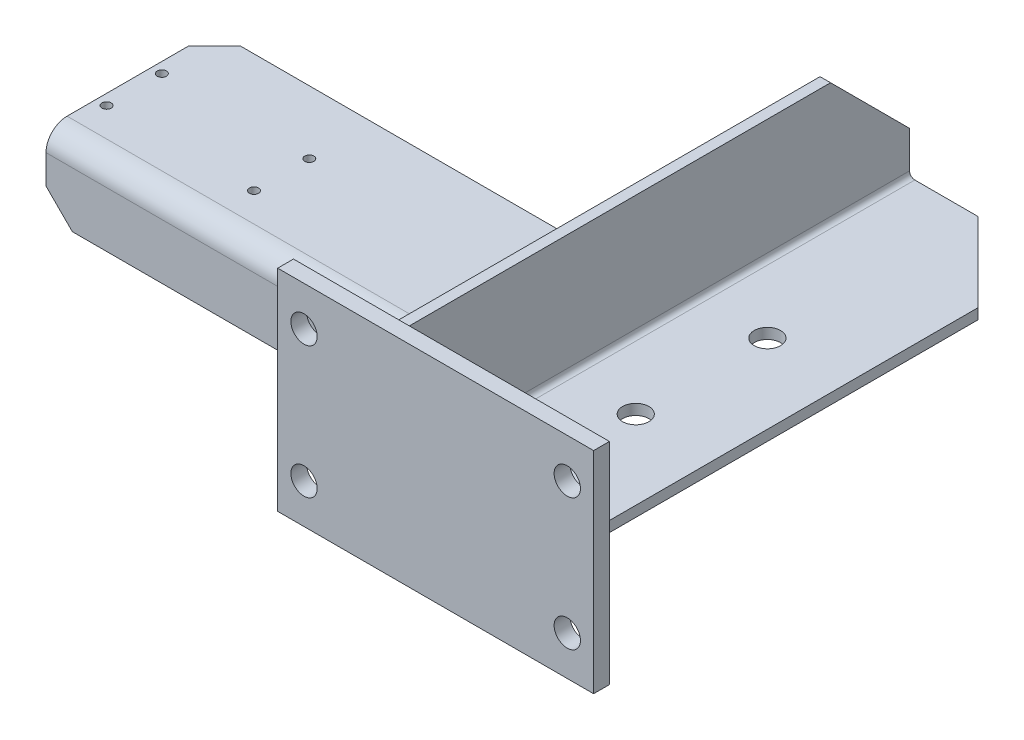
ISO-10303-21;
HEADER;
FILE_DESCRIPTION(('STEP AP214'),'2;1');
FILE_NAME('part.step','',(''),(''),'','','');
FILE_SCHEMA(('AUTOMOTIVE_DESIGN { 1 0 10303 214 1 1 1 1 }'));
ENDSEC;
DATA;
#1=APPLICATION_CONTEXT('core data for automotive mechanical design processes');
#2=APPLICATION_PROTOCOL_DEFINITION('international standard','automotive_design',2000,#1);
#3=PRODUCT_CONTEXT('',#1,'mechanical');
#4=PRODUCT('Part','Part','',(#3));
#5=PRODUCT_RELATED_PRODUCT_CATEGORY('part','',(#4));
#6=PRODUCT_DEFINITION_FORMATION('','',#4);
#7=PRODUCT_DEFINITION_CONTEXT('part definition',#1,'design');
#8=PRODUCT_DEFINITION('design','',#6,#7);
#9=PRODUCT_DEFINITION_SHAPE('','',#8);
#10=(LENGTH_UNIT() NAMED_UNIT(*) SI_UNIT(.MILLI.,.METRE.));
#11=(NAMED_UNIT(*) PLANE_ANGLE_UNIT() SI_UNIT($,.RADIAN.));
#12=(NAMED_UNIT(*) SI_UNIT($,.STERADIAN.) SOLID_ANGLE_UNIT());
#13=UNCERTAINTY_MEASURE_WITH_UNIT(LENGTH_MEASURE(1.E-05),#10,'distance_accuracy_value','');
#14=(GEOMETRIC_REPRESENTATION_CONTEXT(3) GLOBAL_UNCERTAINTY_ASSIGNED_CONTEXT((#13)) GLOBAL_UNIT_ASSIGNED_CONTEXT((#10,
#11,#12)) REPRESENTATION_CONTEXT('',''));
#15=CARTESIAN_POINT('',(0.,0.,0.));
#16=DIRECTION('',(0.,0.,1.));
#17=DIRECTION('',(1.,0.,0.));
#18=AXIS2_PLACEMENT_3D('',#15,#16,#17);
#19=CARTESIAN_POINT('',(0.,0.,206.));
#20=DIRECTION('',(0.,0.,-1.));
#21=DIRECTION('',(-1.,0.,0.));
#22=AXIS2_PLACEMENT_3D('',#19,#20,#21);
#23=PLANE('',#22);
#24=DIRECTION('',(0.,1.,0.));
#25=VECTOR('',#24,1.);
#26=CARTESIAN_POINT('',(90.,60.0000000000001,206.));
#27=LINE('',#26,#25);
#28=CARTESIAN_POINT('',(90.,-19.9999999999999,206.));
#29=VERTEX_POINT('',#28);
#30=CARTESIAN_POINT('',(90.,60.0000000000001,206.));
#31=VERTEX_POINT('',#30);
#32=EDGE_CURVE('E96',#29,#31,#27,.T.);
#33=ORIENTED_EDGE('',*,*,#32,.T.);
#34=DIRECTION('',(-1.,0.,0.));
#35=VECTOR('',#34,1.);
#36=CARTESIAN_POINT('',(90.,60.0000000000001,206.));
#37=LINE('',#36,#35);
#38=CARTESIAN_POINT('',(-30.,60.,206.));
#39=VERTEX_POINT('',#38);
#40=EDGE_CURVE('E91',#31,#39,#37,.T.);
#41=ORIENTED_EDGE('',*,*,#40,.T.);
#42=DIRECTION('',(0.,-1.,0.));
#43=VECTOR('',#42,1.);
#44=CARTESIAN_POINT('',(-30.,60.,206.));
#45=LINE('',#44,#43);
#46=CARTESIAN_POINT('',(-30.,-20.,206.));
#47=VERTEX_POINT('',#46);
#48=EDGE_CURVE('E94',#39,#47,#45,.T.);
#49=ORIENTED_EDGE('',*,*,#48,.T.);
#50=DIRECTION('',(1.,0.,0.));
#51=VECTOR('',#50,1.);
#52=CARTESIAN_POINT('',(90.,-19.9999999999999,206.));
#53=LINE('',#52,#51);
#54=EDGE_CURVE('E61',#47,#29,#53,.T.);
#55=ORIENTED_EDGE('',*,*,#54,.T.);
#56=EDGE_LOOP('',(#33,#41,#49,#55));
#57=FACE_BOUND('',#56,.T.);
#58=CARTESIAN_POINT('',(-20.,45.,206.));
#59=DIRECTION('',(0.,0.,1.));
#60=DIRECTION('',(1.,0.,0.));
#61=AXIS2_PLACEMENT_3D('',#58,#59,#60);
#62=CIRCLE('',#61,5.);
#63=CARTESIAN_POINT('',(-15.,45.,206.));
#64=VERTEX_POINT('',#63);
#65=EDGE_CURVE('E111',#64,#64,#62,.T.);
#66=ORIENTED_EDGE('',*,*,#65,.F.);
#67=EDGE_LOOP('',(#66));
#68=FACE_BOUND('',#67,.T.);
#69=CARTESIAN_POINT('',(80.,45.,206.));
#70=DIRECTION('',(0.,0.,1.));
#71=DIRECTION('',(1.,0.,0.));
#72=AXIS2_PLACEMENT_3D('',#69,#70,#71);
#73=CIRCLE('',#72,5.00000000000001);
#74=CARTESIAN_POINT('',(85.,45.,206.));
#75=VERTEX_POINT('',#74);
#76=EDGE_CURVE('E126',#75,#75,#73,.T.);
#77=ORIENTED_EDGE('',*,*,#76,.F.);
#78=EDGE_LOOP('',(#77));
#79=FACE_BOUND('',#78,.T.);
#80=CARTESIAN_POINT('',(-20.,-4.99999999999997,206.));
#81=DIRECTION('',(0.,0.,1.));
#82=DIRECTION('',(1.,0.,0.));
#83=AXIS2_PLACEMENT_3D('',#80,#81,#82);
#84=CIRCLE('',#83,5.);
#85=CARTESIAN_POINT('',(-15.,-4.99999999999997,206.));
#86=VERTEX_POINT('',#85);
#87=EDGE_CURVE('E132',#86,#86,#84,.T.);
#88=ORIENTED_EDGE('',*,*,#87,.F.);
#89=EDGE_LOOP('',(#88));
#90=FACE_BOUND('',#89,.T.);
#91=CARTESIAN_POINT('',(80.,-4.99999999999998,206.));
#92=DIRECTION('',(0.,0.,1.));
#93=DIRECTION('',(1.,0.,0.));
#94=AXIS2_PLACEMENT_3D('',#91,#92,#93);
#95=CIRCLE('',#94,5.);
#96=CARTESIAN_POINT('',(85.,-4.99999999999998,206.));
#97=VERTEX_POINT('',#96);
#98=EDGE_CURVE('E138',#97,#97,#95,.T.);
#99=ORIENTED_EDGE('',*,*,#98,.F.);
#100=EDGE_LOOP('',(#99));
#101=FACE_BOUND('',#100,.T.);
#102=ADVANCED_FACE('F44',(#57,#68,#79,#90,#101),#23,.F.);
#103=CARTESIAN_POINT('',(0.,0.,200.));
#104=DIRECTION('',(0.,0.,-1.));
#105=DIRECTION('',(-1.,0.,0.));
#106=AXIS2_PLACEMENT_3D('',#103,#104,#105);
#107=PLANE('',#106);
#108=CARTESIAN_POINT('',(-20.,-4.99999999999997,200.));
#109=DIRECTION('',(0.,0.,1.));
#110=DIRECTION('',(1.,0.,0.));
#111=AXIS2_PLACEMENT_3D('',#108,#109,#110);
#112=CIRCLE('',#111,5.);
#113=CARTESIAN_POINT('',(-15.,-4.99999999999997,200.));
#114=VERTEX_POINT('',#113);
#115=EDGE_CURVE('E135',#114,#114,#112,.T.);
#116=ORIENTED_EDGE('',*,*,#115,.T.);
#117=EDGE_LOOP('',(#116));
#118=FACE_BOUND('',#117,.T.);
#119=CARTESIAN_POINT('',(-20.,45.,200.));
#120=DIRECTION('',(0.,0.,1.));
#121=DIRECTION('',(1.,0.,0.));
#122=AXIS2_PLACEMENT_3D('',#119,#120,#121);
#123=CIRCLE('',#122,5.);
#124=CARTESIAN_POINT('',(-15.,45.,200.));
#125=VERTEX_POINT('',#124);
#126=EDGE_CURVE('E123',#125,#125,#123,.T.);
#127=ORIENTED_EDGE('',*,*,#126,.T.);
#128=EDGE_LOOP('',(#127));
#129=FACE_BOUND('',#128,.T.);
#130=DIRECTION('',(0.,1.,0.));
#131=VECTOR('',#130,1.);
#132=CARTESIAN_POINT('',(90.,60.0000000000001,200.));
#133=LINE('',#132,#131);
#134=CARTESIAN_POINT('',(90.,-19.9999999999999,200.));
#135=VERTEX_POINT('',#134);
#136=CARTESIAN_POINT('',(90.,60.0000000000001,200.));
#137=VERTEX_POINT('',#136);
#138=EDGE_CURVE('E108',#135,#137,#133,.T.);
#139=ORIENTED_EDGE('',*,*,#138,.F.);
#140=DIRECTION('',(1.,0.,0.));
#141=VECTOR('',#140,1.);
#142=CARTESIAN_POINT('',(90.,-19.9999999999999,200.));
#143=LINE('',#142,#141);
#144=CARTESIAN_POINT('',(-30.,-20.,200.));
#145=VERTEX_POINT('',#144);
#146=EDGE_CURVE('E84',#145,#135,#143,.T.);
#147=ORIENTED_EDGE('',*,*,#146,.F.);
#148=DIRECTION('',(0.,-1.,0.));
#149=VECTOR('',#148,1.);
#150=CARTESIAN_POINT('',(-30.,60.,200.));
#151=LINE('',#150,#149);
#152=CARTESIAN_POINT('',(-30.,60.,200.));
#153=VERTEX_POINT('',#152);
#154=EDGE_CURVE('E78',#153,#145,#151,.T.);
#155=ORIENTED_EDGE('',*,*,#154,.F.);
#156=DIRECTION('',(-1.,0.,0.));
#157=VECTOR('',#156,1.);
#158=CARTESIAN_POINT('',(90.,60.0000000000001,200.));
#159=LINE('',#158,#157);
#160=EDGE_CURVE('E100',#137,#153,#159,.T.);
#161=ORIENTED_EDGE('',*,*,#160,.F.);
#162=EDGE_LOOP('',(#139,#147,#155,#161));
#163=FACE_BOUND('',#162,.T.);
#164=CARTESIAN_POINT('',(80.,45.,200.));
#165=DIRECTION('',(0.,0.,1.));
#166=DIRECTION('',(1.,0.,0.));
#167=AXIS2_PLACEMENT_3D('',#164,#165,#166);
#168=CIRCLE('',#167,5.00000000000001);
#169=CARTESIAN_POINT('',(85.,45.,200.));
#170=VERTEX_POINT('',#169);
#171=EDGE_CURVE('E129',#170,#170,#168,.T.);
#172=ORIENTED_EDGE('',*,*,#171,.T.);
#173=EDGE_LOOP('',(#172));
#174=FACE_BOUND('',#173,.T.);
#175=CARTESIAN_POINT('',(80.,-4.99999999999998,200.));
#176=DIRECTION('',(0.,0.,1.));
#177=DIRECTION('',(1.,0.,0.));
#178=AXIS2_PLACEMENT_3D('',#175,#176,#177);
#179=CIRCLE('',#178,5.);
#180=CARTESIAN_POINT('',(85.,-4.99999999999998,200.));
#181=VERTEX_POINT('',#180);
#182=EDGE_CURVE('E141',#181,#181,#179,.T.);
#183=ORIENTED_EDGE('',*,*,#182,.T.);
#184=EDGE_LOOP('',(#183));
#185=FACE_BOUND('',#184,.T.);
#186=ADVANCED_FACE('F119',(#118,#129,#163,#174,#185),#107,.T.);
#187=CARTESIAN_POINT('',(90.,60.0000000000001,206.));
#188=DIRECTION('',(-1.,0.,0.));
#189=DIRECTION('',(0.,0.,1.));
#190=AXIS2_PLACEMENT_3D('',#187,#188,#189);
#191=PLANE('',#190);
#192=ORIENTED_EDGE('',*,*,#138,.T.);
#193=DIRECTION('',(0.,0.,-1.));
#194=VECTOR('',#193,1.);
#195=CARTESIAN_POINT('',(90.,60.0000000000001,206.));
#196=LINE('',#195,#194);
#197=EDGE_CURVE('E12',#31,#137,#196,.T.);
#198=ORIENTED_EDGE('',*,*,#197,.F.);
#199=ORIENTED_EDGE('',*,*,#32,.F.);
#200=DIRECTION('',(0.,0.,-1.));
#201=VECTOR('',#200,1.);
#202=CARTESIAN_POINT('',(90.,-19.9999999999999,206.));
#203=LINE('',#202,#201);
#204=EDGE_CURVE('E104',#29,#135,#203,.T.);
#205=ORIENTED_EDGE('',*,*,#204,.T.);
#206=EDGE_LOOP('',(#192,#198,#199,#205));
#207=FACE_BOUND('',#206,.T.);
#208=ADVANCED_FACE('F46',(#207),#191,.F.);
#209=CARTESIAN_POINT('',(90.,60.0000000000001,206.));
#210=DIRECTION('',(0.,-1.,0.));
#211=DIRECTION('',(1.,0.,0.));
#212=AXIS2_PLACEMENT_3D('',#209,#210,#211);
#213=PLANE('',#212);
#214=ORIENTED_EDGE('',*,*,#160,.T.);
#215=DIRECTION('',(0.,0.,-1.));
#216=VECTOR('',#215,1.);
#217=CARTESIAN_POINT('',(-30.,60.,206.));
#218=LINE('',#217,#216);
#219=EDGE_CURVE('E53',#39,#153,#218,.T.);
#220=ORIENTED_EDGE('',*,*,#219,.F.);
#221=ORIENTED_EDGE('',*,*,#40,.F.);
#222=ORIENTED_EDGE('',*,*,#197,.T.);
#223=EDGE_LOOP('',(#214,#220,#221,#222));
#224=FACE_BOUND('',#223,.T.);
#225=ADVANCED_FACE('F99',(#224),#213,.F.);
#226=CARTESIAN_POINT('',(-30.,60.,206.));
#227=DIRECTION('',(1.,0.,0.));
#228=DIRECTION('',(0.,1.,0.));
#229=AXIS2_PLACEMENT_3D('',#226,#227,#228);
#230=PLANE('',#229);
#231=ORIENTED_EDGE('',*,*,#154,.T.);
#232=DIRECTION('',(0.,0.,-1.));
#233=VECTOR('',#232,1.);
#234=CARTESIAN_POINT('',(-30.,-20.,206.));
#235=LINE('',#234,#233);
#236=EDGE_CURVE('E101',#47,#145,#235,.T.);
#237=ORIENTED_EDGE('',*,*,#236,.F.);
#238=ORIENTED_EDGE('',*,*,#48,.F.);
#239=ORIENTED_EDGE('',*,*,#219,.T.);
#240=EDGE_LOOP('',(#231,#237,#238,#239));
#241=FACE_BOUND('',#240,.T.);
#242=ADVANCED_FACE('F102',(#241),#230,.F.);
#243=CARTESIAN_POINT('',(90.,-19.9999999999999,206.));
#244=DIRECTION('',(0.,1.,0.));
#245=DIRECTION('',(-1.,0.,0.));
#246=AXIS2_PLACEMENT_3D('',#243,#244,#245);
#247=PLANE('',#246);
#248=ORIENTED_EDGE('',*,*,#146,.T.);
#249=ORIENTED_EDGE('',*,*,#204,.F.);
#250=ORIENTED_EDGE('',*,*,#54,.F.);
#251=ORIENTED_EDGE('',*,*,#236,.T.);
#252=EDGE_LOOP('',(#248,#249,#250,#251));
#253=FACE_BOUND('',#252,.T.);
#254=ADVANCED_FACE('F116',(#253),#247,.F.);
#255=CARTESIAN_POINT('',(-20.,45.,206.));
#256=DIRECTION('',(0.,0.,-1.));
#257=DIRECTION('',(-1.,0.,0.));
#258=AXIS2_PLACEMENT_3D('',#255,#256,#257);
#259=CYLINDRICAL_SURFACE('',#258,5.);
#260=ORIENTED_EDGE('',*,*,#65,.T.);
#261=EDGE_LOOP('',(#260));
#262=FACE_BOUND('',#261,.T.);
#263=ORIENTED_EDGE('',*,*,#126,.F.);
#264=EDGE_LOOP('',(#263));
#265=FACE_BOUND('',#264,.T.);
#266=ADVANCED_FACE('F158',(#262,#265),#259,.F.);
#267=CARTESIAN_POINT('',(80.,45.,206.));
#268=DIRECTION('',(0.,0.,-1.));
#269=DIRECTION('',(-1.,0.,0.));
#270=AXIS2_PLACEMENT_3D('',#267,#268,#269);
#271=CYLINDRICAL_SURFACE('',#270,5.00000000000001);
#272=ORIENTED_EDGE('',*,*,#76,.T.);
#273=EDGE_LOOP('',(#272));
#274=FACE_BOUND('',#273,.T.);
#275=ORIENTED_EDGE('',*,*,#171,.F.);
#276=EDGE_LOOP('',(#275));
#277=FACE_BOUND('',#276,.T.);
#278=ADVANCED_FACE('F204',(#274,#277),#271,.F.);
#279=CARTESIAN_POINT('',(-20.,-4.99999999999997,206.));
#280=DIRECTION('',(0.,0.,-1.));
#281=DIRECTION('',(-1.,0.,0.));
#282=AXIS2_PLACEMENT_3D('',#279,#280,#281);
#283=CYLINDRICAL_SURFACE('',#282,5.);
#284=ORIENTED_EDGE('',*,*,#87,.T.);
#285=EDGE_LOOP('',(#284));
#286=FACE_BOUND('',#285,.T.);
#287=ORIENTED_EDGE('',*,*,#115,.F.);
#288=EDGE_LOOP('',(#287));
#289=FACE_BOUND('',#288,.T.);
#290=ADVANCED_FACE('F212',(#286,#289),#283,.F.);
#291=CARTESIAN_POINT('',(80.,-4.99999999999998,206.));
#292=DIRECTION('',(0.,0.,-1.));
#293=DIRECTION('',(-1.,0.,0.));
#294=AXIS2_PLACEMENT_3D('',#291,#292,#293);
#295=CYLINDRICAL_SURFACE('',#294,5.);
#296=ORIENTED_EDGE('',*,*,#98,.T.);
#297=EDGE_LOOP('',(#296));
#298=FACE_BOUND('',#297,.T.);
#299=ORIENTED_EDGE('',*,*,#182,.F.);
#300=EDGE_LOOP('',(#299));
#301=FACE_BOUND('',#300,.T.);
#302=ADVANCED_FACE('F147',(#298,#301),#295,.F.);
#303=CLOSED_SHELL('',(#102,#186,#208,#225,#242,#254,#266,#278,#290,#302));
#304=MANIFOLD_SOLID_BREP('B2',#303);
#305=CARTESIAN_POINT('',(0.,6.00000000000004,200.));
#306=DIRECTION('',(1.,0.,0.));
#307=DIRECTION('',(0.,0.,-1.));
#308=AXIS2_PLACEMENT_3D('',#305,#306,#307);
#309=PLANE('',#308);
#310=DIRECTION('',(0.,-1.,0.));
#311=VECTOR('',#310,1.);
#312=CARTESIAN_POINT('',(0.,6.00000000000004,175.));
#313=LINE('',#312,#311);
#314=CARTESIAN_POINT('',(0.,27.,175.));
#315=VERTEX_POINT('',#314);
#316=CARTESIAN_POINT('',(0.,6.00000000000004,175.));
#317=VERTEX_POINT('',#316);
#318=EDGE_CURVE('E422',#315,#317,#313,.T.);
#319=ORIENTED_EDGE('',*,*,#318,.F.);
#320=CARTESIAN_POINT('',(0.,27.,171.));
#321=DIRECTION('',(1.,0.,0.));
#322=DIRECTION('',(0.,0.,-1.));
#323=AXIS2_PLACEMENT_3D('',#320,#321,#322);
#324=CIRCLE('',#323,4.00000000000002);
#325=CARTESIAN_POINT('',(0.,31.,171.));
#326=VERTEX_POINT('',#325);
#327=EDGE_CURVE('E440',#326,#315,#324,.T.);
#328=ORIENTED_EDGE('',*,*,#327,.F.);
#329=DIRECTION('',(0.,0.,1.));
#330=VECTOR('',#329,1.);
#331=CARTESIAN_POINT('',(0.,31.,171.));
#332=LINE('',#331,#330);
#333=CARTESIAN_POINT('',(0.,31.,115.));
#334=VERTEX_POINT('',#333);
#335=EDGE_CURVE('E438',#334,#326,#332,.T.);
#336=ORIENTED_EDGE('',*,*,#335,.F.);
#337=DIRECTION('',(0.,-1.,0.));
#338=VECTOR('',#337,1.);
#339=CARTESIAN_POINT('',(0.,35.,115.));
#340=LINE('',#339,#338);
#341=CARTESIAN_POINT('',(0.,35.,115.));
#342=VERTEX_POINT('',#341);
#343=EDGE_CURVE('E435',#342,#334,#340,.T.);
#344=ORIENTED_EDGE('',*,*,#343,.F.);
#345=DIRECTION('',(0.,0.,-1.));
#346=VECTOR('',#345,1.);
#347=CARTESIAN_POINT('',(0.,35.,171.));
#348=LINE('',#347,#346);
#349=CARTESIAN_POINT('',(0.,35.,171.));
#350=VERTEX_POINT('',#349);
#351=EDGE_CURVE('E432',#350,#342,#348,.T.);
#352=ORIENTED_EDGE('',*,*,#351,.F.);
#353=CARTESIAN_POINT('',(0.,27.,171.));
#354=DIRECTION('',(-1.,0.,0.));
#355=DIRECTION('',(0.,0.,-1.));
#356=AXIS2_PLACEMENT_3D('',#353,#354,#355);
#357=CIRCLE('',#356,8.);
#358=CARTESIAN_POINT('',(0.,27.,179.));
#359=VERTEX_POINT('',#358);
#360=EDGE_CURVE('E430',#359,#350,#357,.T.);
#361=ORIENTED_EDGE('',*,*,#360,.F.);
#362=DIRECTION('',(0.,1.,0.));
#363=VECTOR('',#362,1.);
#364=CARTESIAN_POINT('',(0.,6.00000000000004,179.));
#365=LINE('',#364,#363);
#366=CARTESIAN_POINT('',(0.,6.00000000000004,179.));
#367=VERTEX_POINT('',#366);
#368=EDGE_CURVE('E403',#367,#359,#365,.T.);
#369=ORIENTED_EDGE('',*,*,#368,.F.);
#370=DIRECTION('',(0.,0.,-1.));
#371=VECTOR('',#370,1.);
#372=CARTESIAN_POINT('',(0.,6.00000000000004,200.));
#373=LINE('',#372,#371);
#374=CARTESIAN_POINT('',(0.,6.00000000000004,200.));
#375=VERTEX_POINT('',#374);
#376=EDGE_CURVE('E518',#375,#367,#373,.T.);
#377=ORIENTED_EDGE('',*,*,#376,.F.);
#378=DIRECTION('',(0.,-1.,0.));
#379=VECTOR('',#378,1.);
#380=CARTESIAN_POINT('',(0.,6.00000000000004,200.));
#381=LINE('',#380,#379);
#382=CARTESIAN_POINT('',(0.,50.,200.));
#383=VERTEX_POINT('',#382);
#384=EDGE_CURVE('E471',#383,#375,#381,.T.);
#385=ORIENTED_EDGE('',*,*,#384,.F.);
#386=DIRECTION('',(0.,0.,-1.));
#387=VECTOR('',#386,1.);
#388=CARTESIAN_POINT('',(0.,50.,200.));
#389=LINE('',#388,#387);
#390=CARTESIAN_POINT('',(0.,50.,30.));
#391=VERTEX_POINT('',#390);
#392=EDGE_CURVE('E521',#383,#391,#389,.T.);
#393=ORIENTED_EDGE('',*,*,#392,.T.);
#394=DIRECTION('',(0.,0.707106781186548,0.707106781186547));
#395=VECTOR('',#394,1.);
#396=CARTESIAN_POINT('',(0.,50.,30.));
#397=LINE('',#396,#395);
#398=CARTESIAN_POINT('',(0.,20.,0.));
#399=VERTEX_POINT('',#398);
#400=EDGE_CURVE('E527',#391,#399,#397,.F.);
#401=ORIENTED_EDGE('',*,*,#400,.T.);
#402=DIRECTION('',(0.,-1.,0.));
#403=VECTOR('',#402,1.);
#404=CARTESIAN_POINT('',(0.,6.00000000000004,0.));
#405=LINE('',#404,#403);
#406=CARTESIAN_POINT('',(0.,6.00000000000004,0.));
#407=VERTEX_POINT('',#406);
#408=EDGE_CURVE('E463',#399,#407,#405,.T.);
#409=ORIENTED_EDGE('',*,*,#408,.T.);
#410=EDGE_CURVE('E517',#317,#407,#373,.T.);
#411=ORIENTED_EDGE('',*,*,#410,.F.);
#412=EDGE_LOOP('',(#319,#328,#336,#344,#352,#361,#369,#377,#385,#393,#401,#409,#411));
#413=FACE_BOUND('',#412,.T.);
#414=ADVANCED_FACE('F251',(#413),#309,.F.);
#415=CARTESIAN_POINT('',(4.,50.,200.));
#416=DIRECTION('',(0.,-1.,0.));
#417=DIRECTION('',(0.,0.,-1.));
#418=AXIS2_PLACEMENT_3D('',#415,#416,#417);
#419=PLANE('',#418);
#420=DIRECTION('',(0.,0.,-1.));
#421=VECTOR('',#420,1.);
#422=CARTESIAN_POINT('',(4.,50.,200.));
#423=LINE('',#422,#421);
#424=CARTESIAN_POINT('',(4.,50.,200.));
#425=VERTEX_POINT('',#424);
#426=CARTESIAN_POINT('',(4.,50.,30.));
#427=VERTEX_POINT('',#426);
#428=EDGE_CURVE('E486',#425,#427,#423,.T.);
#429=ORIENTED_EDGE('',*,*,#428,.T.);
#430=DIRECTION('',(-1.,0.,0.));
#431=VECTOR('',#430,1.);
#432=CARTESIAN_POINT('',(4.,50.,30.));
#433=LINE('',#432,#431);
#434=EDGE_CURVE('E524',#427,#391,#433,.T.);
#435=ORIENTED_EDGE('',*,*,#434,.T.);
#436=ORIENTED_EDGE('',*,*,#392,.F.);
#437=DIRECTION('',(-1.,0.,0.));
#438=VECTOR('',#437,1.);
#439=CARTESIAN_POINT('',(4.,50.,200.));
#440=LINE('',#439,#438);
#441=EDGE_CURVE('E468',#425,#383,#440,.T.);
#442=ORIENTED_EDGE('',*,*,#441,.F.);
#443=EDGE_LOOP('',(#429,#435,#436,#442));
#444=FACE_BOUND('',#443,.T.);
#445=ADVANCED_FACE('F582',(#444),#419,.F.);
#446=CARTESIAN_POINT('',(6.,6.,200.));
#447=DIRECTION('',(0.,0.,-1.));
#448=DIRECTION('',(-1.,0.,0.));
#449=AXIS2_PLACEMENT_3D('',#446,#447,#448);
#450=CYLINDRICAL_SURFACE('',#449,6.);
#451=CARTESIAN_POINT('',(6.,6.,0.));
#452=DIRECTION('',(0.,0.,1.));
#453=DIRECTION('',(1.,0.,0.));
#454=AXIS2_PLACEMENT_3D('',#451,#452,#453);
#455=CIRCLE('',#454,6.);
#456=CARTESIAN_POINT('',(6.00000000000004,0.,0.));
#457=VERTEX_POINT('',#456);
#458=EDGE_CURVE('E489',#407,#457,#455,.T.);
#459=ORIENTED_EDGE('',*,*,#458,.T.);
#460=DIRECTION('',(0.,0.,-1.));
#461=VECTOR('',#460,1.);
#462=CARTESIAN_POINT('',(6.00000000000004,0.,200.));
#463=LINE('',#462,#461);
#464=CARTESIAN_POINT('',(6.00000000000004,0.,200.));
#465=VERTEX_POINT('',#464);
#466=EDGE_CURVE('E514',#465,#457,#463,.T.);
#467=ORIENTED_EDGE('',*,*,#466,.F.);
#468=CARTESIAN_POINT('',(6.,6.,200.));
#469=DIRECTION('',(0.,0.,1.));
#470=DIRECTION('',(1.,0.,0.));
#471=AXIS2_PLACEMENT_3D('',#468,#469,#470);
#472=CIRCLE('',#471,6.);
#473=EDGE_CURVE('E474',#375,#465,#472,.T.);
#474=ORIENTED_EDGE('',*,*,#473,.F.);
#475=ORIENTED_EDGE('',*,*,#376,.T.);
#476=DIRECTION('',(0.,0.,1.));
#477=VECTOR('',#476,1.);
#478=CARTESIAN_POINT('',(0.,6.00000000000004,179.));
#479=LINE('',#478,#477);
#480=EDGE_CURVE('E425',#317,#367,#479,.T.);
#481=ORIENTED_EDGE('',*,*,#480,.F.);
#482=ORIENTED_EDGE('',*,*,#410,.T.);
#483=EDGE_LOOP('',(#459,#467,#474,#475,#481,#482));
#484=FACE_BOUND('',#483,.T.);
#485=ADVANCED_FACE('F572',(#484),#450,.T.);
#486=CARTESIAN_POINT('',(6.00000000000004,0.,200.));
#487=DIRECTION('',(0.,1.,0.));
#488=DIRECTION('',(0.,0.,1.));
#489=AXIS2_PLACEMENT_3D('',#486,#487,#488);
#490=PLANE('',#489);
#491=CARTESIAN_POINT('',(30.,0.,130.));
#492=DIRECTION('',(0.,1.,0.));
#493=DIRECTION('',(0.,0.,1.));
#494=AXIS2_PLACEMENT_3D('',#491,#492,#493);
#495=CIRCLE('',#494,5.00000000000001);
#496=CARTESIAN_POINT('',(30.,0.,135.));
#497=VERTEX_POINT('',#496);
#498=EDGE_CURVE('E459',#497,#497,#495,.F.);
#499=ORIENTED_EDGE('',*,*,#498,.F.);
#500=EDGE_LOOP('',(#499));
#501=FACE_BOUND('',#500,.T.);
#502=CARTESIAN_POINT('',(30.,0.,80.));
#503=DIRECTION('',(0.,1.,0.));
#504=DIRECTION('',(0.,0.,1.));
#505=AXIS2_PLACEMENT_3D('',#502,#503,#504);
#506=CIRCLE('',#505,5.00000000000001);
#507=CARTESIAN_POINT('',(30.,0.,85.));
#508=VERTEX_POINT('',#507);
#509=EDGE_CURVE('E460',#508,#508,#506,.F.);
#510=ORIENTED_EDGE('',*,*,#509,.F.);
#511=EDGE_LOOP('',(#510));
#512=FACE_BOUND('',#511,.T.);
#513=DIRECTION('',(1.,0.,0.));
#514=VECTOR('',#513,1.);
#515=CARTESIAN_POINT('',(6.00000000000004,0.,0.));
#516=LINE('',#515,#514);
#517=CARTESIAN_POINT('',(29.9999999999999,0.,0.));
#518=VERTEX_POINT('',#517);
#519=EDGE_CURVE('E491',#457,#518,#516,.T.);
#520=ORIENTED_EDGE('',*,*,#519,.T.);
#521=DIRECTION('',(-0.707106781186549,0.,-0.707106781186546));
#522=VECTOR('',#521,1.);
#523=CARTESIAN_POINT('',(60.,0.,30.));
#524=LINE('',#523,#522);
#525=CARTESIAN_POINT('',(60.,0.,30.));
#526=VERTEX_POINT('',#525);
#527=EDGE_CURVE('E540',#518,#526,#524,.F.);
#528=ORIENTED_EDGE('',*,*,#527,.T.);
#529=DIRECTION('',(0.,0.,-1.));
#530=VECTOR('',#529,1.);
#531=CARTESIAN_POINT('',(60.,0.,200.));
#532=LINE('',#531,#530);
#533=CARTESIAN_POINT('',(60.,0.,200.));
#534=VERTEX_POINT('',#533);
#535=EDGE_CURVE('E511',#534,#526,#532,.T.);
#536=ORIENTED_EDGE('',*,*,#535,.F.);
#537=DIRECTION('',(1.,0.,0.));
#538=VECTOR('',#537,1.);
#539=CARTESIAN_POINT('',(6.00000000000004,0.,200.));
#540=LINE('',#539,#538);
#541=EDGE_CURVE('E476',#465,#534,#540,.T.);
#542=ORIENTED_EDGE('',*,*,#541,.F.);
#543=ORIENTED_EDGE('',*,*,#466,.T.);
#544=EDGE_LOOP('',(#520,#528,#536,#542,#543));
#545=FACE_BOUND('',#544,.T.);
#546=ADVANCED_FACE('F611',(#501,#512,#545),#490,.F.);
#547=CARTESIAN_POINT('',(60.,4.,200.));
#548=DIRECTION('',(-1.,0.,0.));
#549=DIRECTION('',(0.,0.,1.));
#550=AXIS2_PLACEMENT_3D('',#547,#548,#549);
#551=PLANE('',#550);
#552=ORIENTED_EDGE('',*,*,#535,.T.);
#553=DIRECTION('',(0.,1.,0.));
#554=VECTOR('',#553,1.);
#555=CARTESIAN_POINT('',(60.,4.,30.));
#556=LINE('',#555,#554);
#557=CARTESIAN_POINT('',(60.,4.,30.));
#558=VERTEX_POINT('',#557);
#559=EDGE_CURVE('E535',#526,#558,#556,.T.);
#560=ORIENTED_EDGE('',*,*,#559,.T.);
#561=DIRECTION('',(0.,0.,-1.));
#562=VECTOR('',#561,1.);
#563=CARTESIAN_POINT('',(60.,4.,200.));
#564=LINE('',#563,#562);
#565=CARTESIAN_POINT('',(60.,4.,200.));
#566=VERTEX_POINT('',#565);
#567=EDGE_CURVE('E508',#566,#558,#564,.T.);
#568=ORIENTED_EDGE('',*,*,#567,.F.);
#569=DIRECTION('',(0.,1.,0.));
#570=VECTOR('',#569,1.);
#571=CARTESIAN_POINT('',(60.,4.,200.));
#572=LINE('',#571,#570);
#573=EDGE_CURVE('E478',#534,#566,#572,.T.);
#574=ORIENTED_EDGE('',*,*,#573,.F.);
#575=EDGE_LOOP('',(#552,#560,#568,#574));
#576=FACE_BOUND('',#575,.T.);
#577=ADVANCED_FACE('F614',(#576),#551,.F.);
#578=CARTESIAN_POINT('',(6.00000000000004,4.,200.));
#579=DIRECTION('',(0.,-1.,0.));
#580=DIRECTION('',(0.,0.,-1.));
#581=AXIS2_PLACEMENT_3D('',#578,#579,#580);
#582=PLANE('',#581);
#583=CARTESIAN_POINT('',(30.,4.,130.));
#584=DIRECTION('',(0.,1.,0.));
#585=DIRECTION('',(0.,0.,1.));
#586=AXIS2_PLACEMENT_3D('',#583,#584,#585);
#587=CIRCLE('',#586,5.00000000000001);
#588=CARTESIAN_POINT('',(30.,4.,135.));
#589=VERTEX_POINT('',#588);
#590=EDGE_CURVE('E456',#589,#589,#587,.T.);
#591=ORIENTED_EDGE('',*,*,#590,.F.);
#592=EDGE_LOOP('',(#591));
#593=FACE_BOUND('',#592,.T.);
#594=CARTESIAN_POINT('',(30.,4.,80.));
#595=DIRECTION('',(0.,1.,0.));
#596=DIRECTION('',(0.,0.,1.));
#597=AXIS2_PLACEMENT_3D('',#594,#595,#596);
#598=CIRCLE('',#597,5.00000000000001);
#599=CARTESIAN_POINT('',(30.,4.,85.));
#600=VERTEX_POINT('',#599);
#601=EDGE_CURVE('E455',#600,#600,#598,.T.);
#602=ORIENTED_EDGE('',*,*,#601,.F.);
#603=EDGE_LOOP('',(#602));
#604=FACE_BOUND('',#603,.T.);
#605=ORIENTED_EDGE('',*,*,#567,.T.);
#606=DIRECTION('',(0.707106781186549,0.,0.707106781186546));
#607=VECTOR('',#606,1.);
#608=CARTESIAN_POINT('',(60.,4.,30.));
#609=LINE('',#608,#607);
#610=CARTESIAN_POINT('',(29.9999999999999,4.,0.));
#611=VERTEX_POINT('',#610);
#612=EDGE_CURVE('E538',#558,#611,#609,.F.);
#613=ORIENTED_EDGE('',*,*,#612,.T.);
#614=DIRECTION('',(-1.,0.,0.));
#615=VECTOR('',#614,1.);
#616=CARTESIAN_POINT('',(6.00000000000004,4.,0.));
#617=LINE('',#616,#615);
#618=CARTESIAN_POINT('',(6.00000000000004,4.,0.));
#619=VERTEX_POINT('',#618);
#620=EDGE_CURVE('E494',#611,#619,#617,.T.);
#621=ORIENTED_EDGE('',*,*,#620,.T.);
#622=DIRECTION('',(0.,0.,-1.));
#623=VECTOR('',#622,1.);
#624=CARTESIAN_POINT('',(6.00000000000004,4.,200.));
#625=LINE('',#624,#623);
#626=CARTESIAN_POINT('',(6.00000000000004,4.,200.));
#627=VERTEX_POINT('',#626);
#628=EDGE_CURVE('E505',#627,#619,#625,.T.);
#629=ORIENTED_EDGE('',*,*,#628,.F.);
#630=DIRECTION('',(-1.,0.,0.));
#631=VECTOR('',#630,1.);
#632=CARTESIAN_POINT('',(6.00000000000004,4.,200.));
#633=LINE('',#632,#631);
#634=EDGE_CURVE('E480',#566,#627,#633,.T.);
#635=ORIENTED_EDGE('',*,*,#634,.F.);
#636=EDGE_LOOP('',(#605,#613,#621,#629,#635));
#637=FACE_BOUND('',#636,.T.);
#638=ADVANCED_FACE('F617',(#593,#604,#637),#582,.F.);
#639=CARTESIAN_POINT('',(6.,6.,200.));
#640=DIRECTION('',(0.,0.,-1.));
#641=DIRECTION('',(-1.,0.,0.));
#642=AXIS2_PLACEMENT_3D('',#639,#640,#641);
#643=CYLINDRICAL_SURFACE('',#642,2.);
#644=CARTESIAN_POINT('',(6.,6.,0.));
#645=DIRECTION('',(0.,0.,-1.));
#646=DIRECTION('',(1.,0.,0.));
#647=AXIS2_PLACEMENT_3D('',#644,#645,#646);
#648=CIRCLE('',#647,2.);
#649=CARTESIAN_POINT('',(4.,6.00000000000002,0.));
#650=VERTEX_POINT('',#649);
#651=EDGE_CURVE('E496',#619,#650,#648,.T.);
#652=ORIENTED_EDGE('',*,*,#651,.T.);
#653=DIRECTION('',(0.,0.,-1.));
#654=VECTOR('',#653,1.);
#655=CARTESIAN_POINT('',(4.,6.00000000000002,200.));
#656=LINE('',#655,#654);
#657=CARTESIAN_POINT('',(4.,6.00000000000002,200.));
#658=VERTEX_POINT('',#657);
#659=EDGE_CURVE('E502',#658,#650,#656,.T.);
#660=ORIENTED_EDGE('',*,*,#659,.F.);
#661=CARTESIAN_POINT('',(6.,6.,200.));
#662=DIRECTION('',(0.,0.,-1.));
#663=DIRECTION('',(1.,0.,0.));
#664=AXIS2_PLACEMENT_3D('',#661,#662,#663);
#665=CIRCLE('',#664,2.);
#666=EDGE_CURVE('E482',#627,#658,#665,.T.);
#667=ORIENTED_EDGE('',*,*,#666,.F.);
#668=ORIENTED_EDGE('',*,*,#628,.T.);
#669=EDGE_LOOP('',(#652,#660,#667,#668));
#670=FACE_BOUND('',#669,.T.);
#671=ADVANCED_FACE('F600',(#670),#643,.F.);
#672=CARTESIAN_POINT('',(4.,6.00000000000002,200.));
#673=DIRECTION('',(-1.,0.,0.));
#674=DIRECTION('',(0.,0.,1.));
#675=AXIS2_PLACEMENT_3D('',#672,#673,#674);
#676=PLANE('',#675);
#677=DIRECTION('',(0.,1.,0.));
#678=VECTOR('',#677,1.);
#679=CARTESIAN_POINT('',(4.,6.00000000000002,0.));
#680=LINE('',#679,#678);
#681=CARTESIAN_POINT('',(4.,20.,0.));
#682=VERTEX_POINT('',#681);
#683=EDGE_CURVE('E472',#650,#682,#680,.T.);
#684=ORIENTED_EDGE('',*,*,#683,.T.);
#685=DIRECTION('',(0.,-0.707106781186548,-0.707106781186547));
#686=VECTOR('',#685,1.);
#687=CARTESIAN_POINT('',(4.,50.,30.));
#688=LINE('',#687,#686);
#689=EDGE_CURVE('E533',#682,#427,#688,.F.);
#690=ORIENTED_EDGE('',*,*,#689,.T.);
#691=ORIENTED_EDGE('',*,*,#428,.F.);
#692=DIRECTION('',(0.,1.,0.));
#693=VECTOR('',#692,1.);
#694=CARTESIAN_POINT('',(4.,6.00000000000002,200.));
#695=LINE('',#694,#693);
#696=EDGE_CURVE('E484',#658,#425,#695,.T.);
#697=ORIENTED_EDGE('',*,*,#696,.F.);
#698=ORIENTED_EDGE('',*,*,#659,.T.);
#699=EDGE_LOOP('',(#684,#690,#691,#697,#698));
#700=FACE_BOUND('',#699,.T.);
#701=ADVANCED_FACE('F595',(#700),#676,.F.);
#702=CARTESIAN_POINT('',(6.,6.,200.));
#703=DIRECTION('',(0.,0.,1.));
#704=DIRECTION('',(1.,0.,0.));
#705=AXIS2_PLACEMENT_3D('',#702,#703,#704);
#706=PLANE('',#705);
#707=ORIENTED_EDGE('',*,*,#441,.T.);
#708=ORIENTED_EDGE('',*,*,#384,.T.);
#709=ORIENTED_EDGE('',*,*,#473,.T.);
#710=ORIENTED_EDGE('',*,*,#541,.T.);
#711=ORIENTED_EDGE('',*,*,#573,.T.);
#712=ORIENTED_EDGE('',*,*,#634,.T.);
#713=ORIENTED_EDGE('',*,*,#666,.T.);
#714=ORIENTED_EDGE('',*,*,#696,.T.);
#715=EDGE_LOOP('',(#707,#708,#709,#710,#711,#712,#713,#714));
#716=FACE_BOUND('',#715,.T.);
#717=ADVANCED_FACE('F576',(#716),#706,.T.);
#718=CARTESIAN_POINT('',(6.,6.,0.));
#719=DIRECTION('',(0.,0.,1.));
#720=DIRECTION('',(1.,0.,0.));
#721=AXIS2_PLACEMENT_3D('',#718,#719,#720);
#722=PLANE('',#721);
#723=ORIENTED_EDGE('',*,*,#408,.F.);
#724=DIRECTION('',(1.,0.,0.));
#725=VECTOR('',#724,1.);
#726=CARTESIAN_POINT('',(6.,20.,0.));
#727=LINE('',#726,#725);
#728=EDGE_CURVE('E531',#399,#682,#727,.T.);
#729=ORIENTED_EDGE('',*,*,#728,.T.);
#730=ORIENTED_EDGE('',*,*,#683,.F.);
#731=ORIENTED_EDGE('',*,*,#651,.F.);
#732=ORIENTED_EDGE('',*,*,#620,.F.);
#733=DIRECTION('',(0.,-1.,0.));
#734=VECTOR('',#733,1.);
#735=CARTESIAN_POINT('',(29.9999999999999,6.,0.));
#736=LINE('',#735,#734);
#737=EDGE_CURVE('E529',#611,#518,#736,.T.);
#738=ORIENTED_EDGE('',*,*,#737,.T.);
#739=ORIENTED_EDGE('',*,*,#519,.F.);
#740=ORIENTED_EDGE('',*,*,#458,.F.);
#741=EDGE_LOOP('',(#723,#729,#730,#731,#732,#738,#739,#740));
#742=FACE_BOUND('',#741,.T.);
#743=ADVANCED_FACE('F591',(#742),#722,.F.);
#744=CARTESIAN_POINT('',(4.,50.,30.));
#745=DIRECTION('',(0.,-0.707106781186547,0.707106781186548));
#746=DIRECTION('',(-1.,0.,0.));
#747=AXIS2_PLACEMENT_3D('',#744,#745,#746);
#748=PLANE('',#747);
#749=ORIENTED_EDGE('',*,*,#689,.F.);
#750=ORIENTED_EDGE('',*,*,#728,.F.);
#751=ORIENTED_EDGE('',*,*,#400,.F.);
#752=ORIENTED_EDGE('',*,*,#434,.F.);
#753=EDGE_LOOP('',(#749,#750,#751,#752));
#754=FACE_BOUND('',#753,.T.);
#755=ADVANCED_FACE('F587',(#754),#748,.F.);
#756=CARTESIAN_POINT('',(60.,4.,30.));
#757=DIRECTION('',(-0.707106781186546,0.,0.707106781186549));
#758=DIRECTION('',(0.,1.,0.));
#759=AXIS2_PLACEMENT_3D('',#756,#757,#758);
#760=PLANE('',#759);
#761=ORIENTED_EDGE('',*,*,#527,.F.);
#762=ORIENTED_EDGE('',*,*,#737,.F.);
#763=ORIENTED_EDGE('',*,*,#612,.F.);
#764=ORIENTED_EDGE('',*,*,#559,.F.);
#765=EDGE_LOOP('',(#761,#762,#763,#764));
#766=FACE_BOUND('',#765,.T.);
#767=ADVANCED_FACE('F608',(#766),#760,.F.);
#768=CARTESIAN_POINT('',(30.,-20.001,80.));
#769=DIRECTION('',(0.,1.,0.));
#770=DIRECTION('',(0.,0.,1.));
#771=AXIS2_PLACEMENT_3D('',#768,#769,#770);
#772=CYLINDRICAL_SURFACE('',#771,5.00000000000001);
#773=ORIENTED_EDGE('',*,*,#601,.T.);
#774=EDGE_LOOP('',(#773));
#775=FACE_BOUND('',#774,.T.);
#776=ORIENTED_EDGE('',*,*,#509,.T.);
#777=EDGE_LOOP('',(#776));
#778=FACE_BOUND('',#777,.T.);
#779=ADVANCED_FACE('F641',(#775,#778),#772,.F.);
#780=CARTESIAN_POINT('',(30.,-20.001,130.));
#781=DIRECTION('',(0.,1.,0.));
#782=DIRECTION('',(0.,0.,1.));
#783=AXIS2_PLACEMENT_3D('',#780,#781,#782);
#784=CYLINDRICAL_SURFACE('',#783,5.00000000000001);
#785=ORIENTED_EDGE('',*,*,#590,.T.);
#786=EDGE_LOOP('',(#785));
#787=FACE_BOUND('',#786,.T.);
#788=ORIENTED_EDGE('',*,*,#498,.T.);
#789=EDGE_LOOP('',(#788));
#790=FACE_BOUND('',#789,.T.);
#791=ADVANCED_FACE('F678',(#787,#790),#784,.F.);
#792=CARTESIAN_POINT('',(-145.,6.00000000000004,175.));
#793=DIRECTION('',(0.,0.,1.));
#794=DIRECTION('',(0.,-1.,0.));
#795=AXIS2_PLACEMENT_3D('',#792,#793,#794);
#796=PLANE('',#795);
#797=DIRECTION('',(1.,0.,0.));
#798=VECTOR('',#797,1.);
#799=CARTESIAN_POINT('',(-145.,6.00000000000004,175.));
#800=LINE('',#799,#798);
#801=CARTESIAN_POINT('',(-135.,6.00000000000004,175.));
#802=VERTEX_POINT('',#801);
#803=EDGE_CURVE('E453',#802,#317,#800,.T.);
#804=ORIENTED_EDGE('',*,*,#803,.F.);
#805=DIRECTION('',(0.707106781186549,-0.707106781186546,0.));
#806=VECTOR('',#805,1.);
#807=CARTESIAN_POINT('',(-145.,16.0000000000001,175.));
#808=LINE('',#807,#806);
#809=CARTESIAN_POINT('',(-145.,16.0000000000001,175.));
#810=VERTEX_POINT('',#809);
#811=EDGE_CURVE('E550',#802,#810,#808,.F.);
#812=ORIENTED_EDGE('',*,*,#811,.T.);
#813=DIRECTION('',(0.,-1.,0.));
#814=VECTOR('',#813,1.);
#815=CARTESIAN_POINT('',(-145.,6.00000000000004,175.));
#816=LINE('',#815,#814);
#817=CARTESIAN_POINT('',(-145.,27.,175.));
#818=VERTEX_POINT('',#817);
#819=EDGE_CURVE('E397',#818,#810,#816,.T.);
#820=ORIENTED_EDGE('',*,*,#819,.F.);
#821=DIRECTION('',(1.,0.,0.));
#822=VECTOR('',#821,1.);
#823=CARTESIAN_POINT('',(-145.,27.,175.));
#824=LINE('',#823,#822);
#825=EDGE_CURVE('E421',#818,#315,#824,.T.);
#826=ORIENTED_EDGE('',*,*,#825,.T.);
#827=ORIENTED_EDGE('',*,*,#318,.T.);
#828=EDGE_LOOP('',(#804,#812,#820,#826,#827));
#829=FACE_BOUND('',#828,.T.);
#830=ADVANCED_FACE('F556',(#829),#796,.F.);
#831=CARTESIAN_POINT('',(-145.,6.00000000000004,179.));
#832=DIRECTION('',(0.,1.,0.));
#833=DIRECTION('',(0.,0.,1.));
#834=AXIS2_PLACEMENT_3D('',#831,#832,#833);
#835=PLANE('',#834);
#836=DIRECTION('',(1.,0.,0.));
#837=VECTOR('',#836,1.);
#838=CARTESIAN_POINT('',(-145.,6.00000000000004,179.));
#839=LINE('',#838,#837);
#840=CARTESIAN_POINT('',(-135.,6.00000000000004,179.));
#841=VERTEX_POINT('',#840);
#842=EDGE_CURVE('E406',#841,#367,#839,.T.);
#843=ORIENTED_EDGE('',*,*,#842,.F.);
#844=DIRECTION('',(0.,0.,-1.));
#845=VECTOR('',#844,1.);
#846=CARTESIAN_POINT('',(-135.,6.00000000000004,179.));
#847=LINE('',#846,#845);
#848=EDGE_CURVE('E548',#841,#802,#847,.T.);
#849=ORIENTED_EDGE('',*,*,#848,.T.);
#850=ORIENTED_EDGE('',*,*,#803,.T.);
#851=ORIENTED_EDGE('',*,*,#480,.T.);
#852=EDGE_LOOP('',(#843,#849,#850,#851));
#853=FACE_BOUND('',#852,.T.);
#854=ADVANCED_FACE('F564',(#853),#835,.F.);
#855=CARTESIAN_POINT('',(-145.,6.00000000000004,179.));
#856=DIRECTION('',(0.,0.,-1.));
#857=DIRECTION('',(-1.,0.,0.));
#858=AXIS2_PLACEMENT_3D('',#855,#856,#857);
#859=PLANE('',#858);
#860=DIRECTION('',(0.,1.,0.));
#861=VECTOR('',#860,1.);
#862=CARTESIAN_POINT('',(-145.,6.00000000000004,179.));
#863=LINE('',#862,#861);
#864=CARTESIAN_POINT('',(-145.,16.0000000000001,179.));
#865=VERTEX_POINT('',#864);
#866=CARTESIAN_POINT('',(-145.,27.,179.));
#867=VERTEX_POINT('',#866);
#868=EDGE_CURVE('E386',#865,#867,#863,.T.);
#869=ORIENTED_EDGE('',*,*,#868,.F.);
#870=DIRECTION('',(-0.707106781186549,0.707106781186546,0.));
#871=VECTOR('',#870,1.);
#872=CARTESIAN_POINT('',(-145.,16.0000000000001,179.));
#873=LINE('',#872,#871);
#874=EDGE_CURVE('E546',#865,#841,#873,.F.);
#875=ORIENTED_EDGE('',*,*,#874,.T.);
#876=ORIENTED_EDGE('',*,*,#842,.T.);
#877=ORIENTED_EDGE('',*,*,#368,.T.);
#878=DIRECTION('',(1.,0.,0.));
#879=VECTOR('',#878,1.);
#880=CARTESIAN_POINT('',(-145.,27.,179.));
#881=LINE('',#880,#879);
#882=EDGE_CURVE('E400',#867,#359,#881,.T.);
#883=ORIENTED_EDGE('',*,*,#882,.F.);
#884=EDGE_LOOP('',(#869,#875,#876,#877,#883));
#885=FACE_BOUND('',#884,.T.);
#886=ADVANCED_FACE('F401',(#885),#859,.F.);
#887=CARTESIAN_POINT('',(-145.,27.,171.));
#888=DIRECTION('',(1.,0.,0.));
#889=DIRECTION('',(0.,0.,-1.));
#890=AXIS2_PLACEMENT_3D('',#887,#888,#889);
#891=CYLINDRICAL_SURFACE('',#890,8.);
#892=ORIENTED_EDGE('',*,*,#360,.T.);
#893=DIRECTION('',(1.,0.,0.));
#894=VECTOR('',#893,1.);
#895=CARTESIAN_POINT('',(-145.,35.,171.));
#896=LINE('',#895,#894);
#897=CARTESIAN_POINT('',(-145.,35.,171.));
#898=VERTEX_POINT('',#897);
#899=EDGE_CURVE('E407',#898,#350,#896,.T.);
#900=ORIENTED_EDGE('',*,*,#899,.F.);
#901=CARTESIAN_POINT('',(-145.,27.,171.));
#902=DIRECTION('',(-1.,0.,0.));
#903=DIRECTION('',(0.,0.,-1.));
#904=AXIS2_PLACEMENT_3D('',#901,#902,#903);
#905=CIRCLE('',#904,8.);
#906=EDGE_CURVE('E392',#867,#898,#905,.T.);
#907=ORIENTED_EDGE('',*,*,#906,.F.);
#908=ORIENTED_EDGE('',*,*,#882,.T.);
#909=EDGE_LOOP('',(#892,#900,#907,#908));
#910=FACE_BOUND('',#909,.T.);
#911=ADVANCED_FACE('F409',(#910),#891,.T.);
#912=CARTESIAN_POINT('',(-145.,35.,171.));
#913=DIRECTION('',(0.,-1.,0.));
#914=DIRECTION('',(0.,0.,-1.));
#915=AXIS2_PLACEMENT_3D('',#912,#913,#914);
#916=PLANE('',#915);
#917=CARTESIAN_POINT('',(-84.9999999999995,35.,160.));
#918=DIRECTION('',(0.,-1.,0.));
#919=DIRECTION('',(0.,0.,-1.));
#920=AXIS2_PLACEMENT_3D('',#917,#918,#919);
#921=CIRCLE('',#920,1.74999999999997);
#922=CARTESIAN_POINT('',(-84.9999999999995,35.,158.25));
#923=VERTEX_POINT('',#922);
#924=EDGE_CURVE('E817',#923,#923,#921,.F.);
#925=ORIENTED_EDGE('',*,*,#924,.F.);
#926=EDGE_LOOP('',(#925));
#927=FACE_BOUND('',#926,.T.);
#928=CARTESIAN_POINT('',(-84.9999999999995,35.,139.));
#929=DIRECTION('',(0.,-1.,0.));
#930=DIRECTION('',(0.,0.,-1.));
#931=AXIS2_PLACEMENT_3D('',#928,#929,#930);
#932=CIRCLE('',#931,1.75000000000001);
#933=CARTESIAN_POINT('',(-84.9999999999995,35.,137.25));
#934=VERTEX_POINT('',#933);
#935=EDGE_CURVE('E821',#934,#934,#932,.F.);
#936=ORIENTED_EDGE('',*,*,#935,.F.);
#937=EDGE_LOOP('',(#936));
#938=FACE_BOUND('',#937,.T.);
#939=CARTESIAN_POINT('',(-141.,35.,139.));
#940=DIRECTION('',(0.,-1.,0.));
#941=DIRECTION('',(0.,0.,-1.));
#942=AXIS2_PLACEMENT_3D('',#939,#940,#941);
#943=CIRCLE('',#942,1.74999999999998);
#944=CARTESIAN_POINT('',(-141.,35.,137.25));
#945=VERTEX_POINT('',#944);
#946=EDGE_CURVE('E829',#945,#945,#943,.F.);
#947=ORIENTED_EDGE('',*,*,#946,.F.);
#948=EDGE_LOOP('',(#947));
#949=FACE_BOUND('',#948,.T.);
#950=CARTESIAN_POINT('',(-141.,35.,160.));
#951=DIRECTION('',(0.,-1.,0.));
#952=DIRECTION('',(0.,0.,-1.));
#953=AXIS2_PLACEMENT_3D('',#950,#951,#952);
#954=CIRCLE('',#953,1.74999999999998);
#955=CARTESIAN_POINT('',(-141.,35.,158.25));
#956=VERTEX_POINT('',#955);
#957=EDGE_CURVE('E426',#956,#956,#954,.F.);
#958=ORIENTED_EDGE('',*,*,#957,.F.);
#959=EDGE_LOOP('',(#958));
#960=FACE_BOUND('',#959,.T.);
#961=DIRECTION('',(1.,0.,0.));
#962=VECTOR('',#961,1.);
#963=CARTESIAN_POINT('',(-145.,35.,115.));
#964=LINE('',#963,#962);
#965=CARTESIAN_POINT('',(-135.,35.,115.));
#966=VERTEX_POINT('',#965);
#967=EDGE_CURVE('E449',#966,#342,#964,.T.);
#968=ORIENTED_EDGE('',*,*,#967,.F.);
#969=DIRECTION('',(0.70710678118655,0.,-0.707106781186545));
#970=VECTOR('',#969,1.);
#971=CARTESIAN_POINT('',(-145.,35.,125.));
#972=LINE('',#971,#970);
#973=CARTESIAN_POINT('',(-145.,35.,125.));
#974=VERTEX_POINT('',#973);
#975=EDGE_CURVE('E42',#966,#974,#972,.F.);
#976=ORIENTED_EDGE('',*,*,#975,.T.);
#977=DIRECTION('',(0.,0.,-1.));
#978=VECTOR('',#977,1.);
#979=CARTESIAN_POINT('',(-145.,35.,171.));
#980=LINE('',#979,#978);
#981=EDGE_CURVE('E412',#898,#974,#980,.T.);
#982=ORIENTED_EDGE('',*,*,#981,.F.);
#983=ORIENTED_EDGE('',*,*,#899,.T.);
#984=ORIENTED_EDGE('',*,*,#351,.T.);
#985=EDGE_LOOP('',(#968,#976,#982,#983,#984));
#986=FACE_BOUND('',#985,.T.);
#987=ADVANCED_FACE('F666',(#927,#938,#949,#960,#986),#916,.F.);
#988=CARTESIAN_POINT('',(-145.,35.,115.));
#989=DIRECTION('',(0.,0.,1.));
#990=DIRECTION('',(1.,0.,0.));
#991=AXIS2_PLACEMENT_3D('',#988,#989,#990);
#992=PLANE('',#991);
#993=DIRECTION('',(1.,0.,0.));
#994=VECTOR('',#993,1.);
#995=CARTESIAN_POINT('',(-145.,31.,115.));
#996=LINE('',#995,#994);
#997=CARTESIAN_POINT('',(-135.,31.,115.));
#998=VERTEX_POINT('',#997);
#999=EDGE_CURVE('E447',#998,#334,#996,.T.);
#1000=ORIENTED_EDGE('',*,*,#999,.F.);
#1001=DIRECTION('',(0.,1.,0.));
#1002=VECTOR('',#1001,1.);
#1003=CARTESIAN_POINT('',(-135.,35.,115.));
#1004=LINE('',#1003,#1002);
#1005=EDGE_CURVE('E259',#998,#966,#1004,.T.);
#1006=ORIENTED_EDGE('',*,*,#1005,.T.);
#1007=ORIENTED_EDGE('',*,*,#967,.T.);
#1008=ORIENTED_EDGE('',*,*,#343,.T.);
#1009=EDGE_LOOP('',(#1000,#1006,#1007,#1008));
#1010=FACE_BOUND('',#1009,.T.);
#1011=ADVANCED_FACE('F662',(#1010),#992,.F.);
#1012=CARTESIAN_POINT('',(-145.,31.,171.));
#1013=DIRECTION('',(0.,1.,0.));
#1014=DIRECTION('',(0.,0.,1.));
#1015=AXIS2_PLACEMENT_3D('',#1012,#1013,#1014);
#1016=PLANE('',#1015);
#1017=CARTESIAN_POINT('',(-84.9999999999995,31.,160.));
#1018=DIRECTION('',(0.,-1.,0.));
#1019=DIRECTION('',(0.,0.,-1.));
#1020=AXIS2_PLACEMENT_3D('',#1017,#1018,#1019);
#1021=CIRCLE('',#1020,1.74999999999997);
#1022=CARTESIAN_POINT('',(-84.9999999999995,31.,158.25));
#1023=VERTEX_POINT('',#1022);
#1024=EDGE_CURVE('E814',#1023,#1023,#1021,.T.);
#1025=ORIENTED_EDGE('',*,*,#1024,.F.);
#1026=EDGE_LOOP('',(#1025));
#1027=FACE_BOUND('',#1026,.T.);
#1028=CARTESIAN_POINT('',(-84.9999999999995,31.,139.));
#1029=DIRECTION('',(0.,-1.,0.));
#1030=DIRECTION('',(0.,0.,-1.));
#1031=AXIS2_PLACEMENT_3D('',#1028,#1029,#1030);
#1032=CIRCLE('',#1031,1.75000000000001);
#1033=CARTESIAN_POINT('',(-84.9999999999995,31.,137.25));
#1034=VERTEX_POINT('',#1033);
#1035=EDGE_CURVE('E818',#1034,#1034,#1032,.T.);
#1036=ORIENTED_EDGE('',*,*,#1035,.F.);
#1037=EDGE_LOOP('',(#1036));
#1038=FACE_BOUND('',#1037,.T.);
#1039=CARTESIAN_POINT('',(-141.,31.,139.));
#1040=DIRECTION('',(0.,-1.,0.));
#1041=DIRECTION('',(0.,0.,-1.));
#1042=AXIS2_PLACEMENT_3D('',#1039,#1040,#1041);
#1043=CIRCLE('',#1042,1.74999999999998);
#1044=CARTESIAN_POINT('',(-141.,31.,137.25));
#1045=VERTEX_POINT('',#1044);
#1046=EDGE_CURVE('E844',#1045,#1045,#1043,.T.);
#1047=ORIENTED_EDGE('',*,*,#1046,.F.);
#1048=EDGE_LOOP('',(#1047));
#1049=FACE_BOUND('',#1048,.T.);
#1050=CARTESIAN_POINT('',(-141.,31.,160.));
#1051=DIRECTION('',(0.,-1.,0.));
#1052=DIRECTION('',(0.,0.,-1.));
#1053=AXIS2_PLACEMENT_3D('',#1050,#1051,#1052);
#1054=CIRCLE('',#1053,1.74999999999998);
#1055=CARTESIAN_POINT('',(-141.,31.,158.25));
#1056=VERTEX_POINT('',#1055);
#1057=EDGE_CURVE('E826',#1056,#1056,#1054,.T.);
#1058=ORIENTED_EDGE('',*,*,#1057,.F.);
#1059=EDGE_LOOP('',(#1058));
#1060=FACE_BOUND('',#1059,.T.);
#1061=DIRECTION('',(0.,0.,1.));
#1062=VECTOR('',#1061,1.);
#1063=CARTESIAN_POINT('',(-145.,31.,171.));
#1064=LINE('',#1063,#1062);
#1065=CARTESIAN_POINT('',(-145.,31.,125.));
#1066=VERTEX_POINT('',#1065);
#1067=CARTESIAN_POINT('',(-145.,31.,171.));
#1068=VERTEX_POINT('',#1067);
#1069=EDGE_CURVE('E414',#1066,#1068,#1064,.T.);
#1070=ORIENTED_EDGE('',*,*,#1069,.F.);
#1071=DIRECTION('',(-0.70710678118655,0.,0.707106781186545));
#1072=VECTOR('',#1071,1.);
#1073=CARTESIAN_POINT('',(-145.,31.,125.));
#1074=LINE('',#1073,#1072);
#1075=EDGE_CURVE('E273',#1066,#998,#1074,.F.);
#1076=ORIENTED_EDGE('',*,*,#1075,.T.);
#1077=ORIENTED_EDGE('',*,*,#999,.T.);
#1078=ORIENTED_EDGE('',*,*,#335,.T.);
#1079=DIRECTION('',(1.,0.,0.));
#1080=VECTOR('',#1079,1.);
#1081=CARTESIAN_POINT('',(-145.,31.,171.));
#1082=LINE('',#1081,#1080);
#1083=EDGE_CURVE('E444',#1068,#326,#1082,.T.);
#1084=ORIENTED_EDGE('',*,*,#1083,.F.);
#1085=EDGE_LOOP('',(#1070,#1076,#1077,#1078,#1084));
#1086=FACE_BOUND('',#1085,.T.);
#1087=ADVANCED_FACE('F654',(#1027,#1038,#1049,#1060,#1086),#1016,.F.);
#1088=CARTESIAN_POINT('',(-145.,27.,171.));
#1089=DIRECTION('',(1.,0.,0.));
#1090=DIRECTION('',(0.,0.,-1.));
#1091=AXIS2_PLACEMENT_3D('',#1088,#1089,#1090);
#1092=CYLINDRICAL_SURFACE('',#1091,4.00000000000002);
#1093=ORIENTED_EDGE('',*,*,#327,.T.);
#1094=ORIENTED_EDGE('',*,*,#825,.F.);
#1095=CARTESIAN_POINT('',(-145.,27.,171.));
#1096=DIRECTION('',(1.,0.,0.));
#1097=DIRECTION('',(0.,0.,-1.));
#1098=AXIS2_PLACEMENT_3D('',#1095,#1096,#1097);
#1099=CIRCLE('',#1098,4.00000000000002);
#1100=EDGE_CURVE('E419',#1068,#818,#1099,.T.);
#1101=ORIENTED_EDGE('',*,*,#1100,.F.);
#1102=ORIENTED_EDGE('',*,*,#1083,.T.);
#1103=EDGE_LOOP('',(#1093,#1094,#1101,#1102));
#1104=FACE_BOUND('',#1103,.T.);
#1105=ADVANCED_FACE('F649',(#1104),#1092,.F.);
#1106=CARTESIAN_POINT('',(-145.,27.,171.));
#1107=DIRECTION('',(1.,0.,0.));
#1108=DIRECTION('',(0.,0.,-1.));
#1109=AXIS2_PLACEMENT_3D('',#1106,#1107,#1108);
#1110=PLANE('',#1109);
#1111=ORIENTED_EDGE('',*,*,#819,.T.);
#1112=DIRECTION('',(0.,0.,1.));
#1113=VECTOR('',#1112,1.);
#1114=CARTESIAN_POINT('',(-145.,16.0000000000001,171.));
#1115=LINE('',#1114,#1113);
#1116=EDGE_CURVE('E395',#810,#865,#1115,.T.);
#1117=ORIENTED_EDGE('',*,*,#1116,.T.);
#1118=ORIENTED_EDGE('',*,*,#868,.T.);
#1119=ORIENTED_EDGE('',*,*,#906,.T.);
#1120=ORIENTED_EDGE('',*,*,#981,.T.);
#1121=DIRECTION('',(0.,-1.,0.));
#1122=VECTOR('',#1121,1.);
#1123=CARTESIAN_POINT('',(-145.,27.,125.));
#1124=LINE('',#1123,#1122);
#1125=EDGE_CURVE('E542',#974,#1066,#1124,.T.);
#1126=ORIENTED_EDGE('',*,*,#1125,.T.);
#1127=ORIENTED_EDGE('',*,*,#1069,.T.);
#1128=ORIENTED_EDGE('',*,*,#1100,.T.);
#1129=EDGE_LOOP('',(#1111,#1117,#1118,#1119,#1120,#1126,#1127,#1128));
#1130=FACE_BOUND('',#1129,.T.);
#1131=ADVANCED_FACE('F389',(#1130),#1110,.F.);
#1132=CARTESIAN_POINT('',(-145.,16.0000000000001,171.));
#1133=DIRECTION('',(0.707106781186546,0.707106781186549,0.));
#1134=DIRECTION('',(0.,0.,1.));
#1135=AXIS2_PLACEMENT_3D('',#1132,#1133,#1134);
#1136=PLANE('',#1135);
#1137=ORIENTED_EDGE('',*,*,#811,.F.);
#1138=ORIENTED_EDGE('',*,*,#848,.F.);
#1139=ORIENTED_EDGE('',*,*,#874,.F.);
#1140=ORIENTED_EDGE('',*,*,#1116,.F.);
#1141=EDGE_LOOP('',(#1137,#1138,#1139,#1140));
#1142=FACE_BOUND('',#1141,.T.);
#1143=ADVANCED_FACE('F561',(#1142),#1136,.F.);
#1144=CARTESIAN_POINT('',(-145.,27.,125.));
#1145=DIRECTION('',(0.707106781186545,0.,0.70710678118655));
#1146=DIRECTION('',(0.,-1.,0.));
#1147=AXIS2_PLACEMENT_3D('',#1144,#1145,#1146);
#1148=PLANE('',#1147);
#1149=ORIENTED_EDGE('',*,*,#975,.F.);
#1150=ORIENTED_EDGE('',*,*,#1005,.F.);
#1151=ORIENTED_EDGE('',*,*,#1075,.F.);
#1152=ORIENTED_EDGE('',*,*,#1125,.F.);
#1153=EDGE_LOOP('',(#1149,#1150,#1151,#1152));
#1154=FACE_BOUND('',#1153,.T.);
#1155=ADVANCED_FACE('F253',(#1154),#1148,.F.);
#1156=CARTESIAN_POINT('',(-141.,60.0010000000001,160.));
#1157=DIRECTION('',(0.,-1.,0.));
#1158=DIRECTION('',(0.,0.,-1.));
#1159=AXIS2_PLACEMENT_3D('',#1156,#1157,#1158);
#1160=CYLINDRICAL_SURFACE('',#1159,1.74999999999998);
#1161=ORIENTED_EDGE('',*,*,#1057,.T.);
#1162=EDGE_LOOP('',(#1161));
#1163=FACE_BOUND('',#1162,.T.);
#1164=ORIENTED_EDGE('',*,*,#957,.T.);
#1165=EDGE_LOOP('',(#1164));
#1166=FACE_BOUND('',#1165,.T.);
#1167=ADVANCED_FACE('F647',(#1163,#1166),#1160,.F.);
#1168=CARTESIAN_POINT('',(-141.,60.0010000000001,139.));
#1169=DIRECTION('',(0.,-1.,0.));
#1170=DIRECTION('',(0.,0.,-1.));
#1171=AXIS2_PLACEMENT_3D('',#1168,#1169,#1170);
#1172=CYLINDRICAL_SURFACE('',#1171,1.74999999999998);
#1173=ORIENTED_EDGE('',*,*,#1046,.T.);
#1174=EDGE_LOOP('',(#1173));
#1175=FACE_BOUND('',#1174,.T.);
#1176=ORIENTED_EDGE('',*,*,#946,.T.);
#1177=EDGE_LOOP('',(#1176));
#1178=FACE_BOUND('',#1177,.T.);
#1179=ADVANCED_FACE('F779',(#1175,#1178),#1172,.F.);
#1180=CARTESIAN_POINT('',(-84.9999999999995,60.0010000000001,139.));
#1181=DIRECTION('',(0.,-1.,0.));
#1182=DIRECTION('',(0.,0.,-1.));
#1183=AXIS2_PLACEMENT_3D('',#1180,#1181,#1182);
#1184=CYLINDRICAL_SURFACE('',#1183,1.75000000000001);
#1185=ORIENTED_EDGE('',*,*,#1035,.T.);
#1186=EDGE_LOOP('',(#1185));
#1187=FACE_BOUND('',#1186,.T.);
#1188=ORIENTED_EDGE('',*,*,#935,.T.);
#1189=EDGE_LOOP('',(#1188));
#1190=FACE_BOUND('',#1189,.T.);
#1191=ADVANCED_FACE('F787',(#1187,#1190),#1184,.F.);
#1192=CARTESIAN_POINT('',(-84.9999999999995,60.0010000000001,160.));
#1193=DIRECTION('',(0.,-1.,0.));
#1194=DIRECTION('',(0.,0.,-1.));
#1195=AXIS2_PLACEMENT_3D('',#1192,#1193,#1194);
#1196=CYLINDRICAL_SURFACE('',#1195,1.74999999999997);
#1197=ORIENTED_EDGE('',*,*,#1024,.T.);
#1198=EDGE_LOOP('',(#1197));
#1199=FACE_BOUND('',#1198,.T.);
#1200=ORIENTED_EDGE('',*,*,#924,.T.);
#1201=EDGE_LOOP('',(#1200));
#1202=FACE_BOUND('',#1201,.T.);
#1203=ADVANCED_FACE('F796',(#1199,#1202),#1196,.F.);
#1204=CLOSED_SHELL('',(#414,#445,#485,#546,#577,#638,#671,#701,#717,#743,#755,#767,#779,#791,
#830,#854,#886,#911,#987,#1011,#1087,#1105,#1131,#1143,#1155,#1167,#1179,#1191,#1203));
#1205=MANIFOLD_SOLID_BREP('B6',#1204);
#1206=ADVANCED_BREP_SHAPE_REPRESENTATION('',(#18,#304,#1205),#14);
#1207=SHAPE_DEFINITION_REPRESENTATION(#9,#1206);
ENDSEC;
END-ISO-10303-21;
